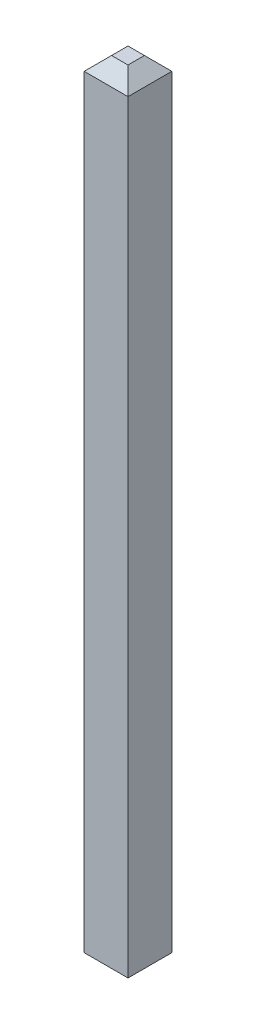
ISO-10303-21;
HEADER;
FILE_DESCRIPTION(('STEP AP214'),'2;1');
FILE_NAME('part.step','',(''),(''),'','','');
FILE_SCHEMA(('AUTOMOTIVE_DESIGN { 1 0 10303 214 1 1 1 1 }'));
ENDSEC;
DATA;
#1=APPLICATION_CONTEXT('core data for automotive mechanical design processes');
#2=APPLICATION_PROTOCOL_DEFINITION('international standard','automotive_design',2000,#1);
#3=PRODUCT_CONTEXT('',#1,'mechanical');
#4=PRODUCT('Part','Part','',(#3));
#5=PRODUCT_RELATED_PRODUCT_CATEGORY('part','',(#4));
#6=PRODUCT_DEFINITION_FORMATION('','',#4);
#7=PRODUCT_DEFINITION_CONTEXT('part definition',#1,'design');
#8=PRODUCT_DEFINITION('design','',#6,#7);
#9=PRODUCT_DEFINITION_SHAPE('','',#8);
#10=(LENGTH_UNIT() NAMED_UNIT(*) SI_UNIT(.MILLI.,.METRE.));
#11=(NAMED_UNIT(*) PLANE_ANGLE_UNIT() SI_UNIT($,.RADIAN.));
#12=(NAMED_UNIT(*) SI_UNIT($,.STERADIAN.) SOLID_ANGLE_UNIT());
#13=UNCERTAINTY_MEASURE_WITH_UNIT(LENGTH_MEASURE(1.E-05),#10,'distance_accuracy_value','');
#14=(GEOMETRIC_REPRESENTATION_CONTEXT(3) GLOBAL_UNCERTAINTY_ASSIGNED_CONTEXT((#13)) GLOBAL_UNIT_ASSIGNED_CONTEXT((#10,
#11,#12)) REPRESENTATION_CONTEXT('',''));
#15=CARTESIAN_POINT('',(0.,0.,0.));
#16=DIRECTION('',(0.,0.,1.));
#17=DIRECTION('',(1.,0.,0.));
#18=AXIS2_PLACEMENT_3D('',#15,#16,#17);
#19=CARTESIAN_POINT('',(-8.57,7.07,-0.32));
#20=DIRECTION('',(-0.707106781186548,-0.707106781186548,0.));
#21=DIRECTION('',(-0.707106781186548,0.707106781186548,0.));
#22=AXIS2_PLACEMENT_3D('',#19,#20,#21);
#23=PLANE('',#22);
#24=DIRECTION('',(0.577350269189626,-0.577350269189626,0.577350269189626));
#25=VECTOR('',#24,1.);
#26=CARTESIAN_POINT('',(-8.783333333333,7.283333333333,0.106666666667));
#27=LINE('',#26,#25);
#28=CARTESIAN_POINT('',(-8.77,7.27,0.12));
#29=VERTEX_POINT('',#28);
#30=CARTESIAN_POINT('',(-8.57,7.07,0.32));
#31=VERTEX_POINT('',#30);
#32=EDGE_CURVE('E68',#29,#31,#27,.T.);
#33=ORIENTED_EDGE('',*,*,#32,.T.);
#34=DIRECTION('',(0.,0.,1.));
#35=VECTOR('',#34,1.);
#36=CARTESIAN_POINT('',(-8.57,7.07,-0.32));
#37=LINE('',#36,#35);
#38=CARTESIAN_POINT('',(-8.57,7.07,-0.32));
#39=VERTEX_POINT('',#38);
#40=EDGE_CURVE('E183',#39,#31,#37,.T.);
#41=ORIENTED_EDGE('',*,*,#40,.F.);
#42=DIRECTION('',(0.577350269189626,-0.577350269189626,-0.577350269189626));
#43=VECTOR('',#42,1.);
#44=CARTESIAN_POINT('',(-8.57,7.07,-0.32));
#45=LINE('',#44,#43);
#46=CARTESIAN_POINT('',(-8.77,7.27,-0.12));
#47=VERTEX_POINT('',#46);
#48=EDGE_CURVE('E11',#47,#39,#45,.T.);
#49=ORIENTED_EDGE('',*,*,#48,.F.);
#50=DIRECTION('',(0.,0.,-1.));
#51=VECTOR('',#50,1.);
#52=CARTESIAN_POINT('',(-8.77,7.27,-0.32));
#53=LINE('',#52,#51);
#54=EDGE_CURVE('E186',#29,#47,#53,.T.);
#55=ORIENTED_EDGE('',*,*,#54,.F.);
#56=EDGE_LOOP('',(#33,#41,#49,#55));
#57=FACE_BOUND('',#56,.T.);
#58=ADVANCED_FACE('F17',(#57),#23,.F.);
#59=CARTESIAN_POINT('',(-8.89,7.07,-0.32));
#60=DIRECTION('',(0.,0.707106781186548,-0.707106781186548));
#61=DIRECTION('',(-1.,0.,0.));
#62=AXIS2_PLACEMENT_3D('',#59,#60,#61);
#63=PLANE('',#62);
#64=DIRECTION('',(0.577350269189626,0.577350269189626,0.577350269189626));
#65=VECTOR('',#64,1.);
#66=CARTESIAN_POINT('',(-9.076666666667,7.203333333333,-0.186666666667));
#67=LINE('',#66,#65);
#68=CARTESIAN_POINT('',(-9.21,7.07,-0.32));
#69=VERTEX_POINT('',#68);
#70=CARTESIAN_POINT('',(-9.01,7.27,-0.12));
#71=VERTEX_POINT('',#70);
#72=EDGE_CURVE('E20',#69,#71,#67,.T.);
#73=ORIENTED_EDGE('',*,*,#72,.T.);
#74=DIRECTION('',(-1.,0.,0.));
#75=VECTOR('',#74,1.);
#76=CARTESIAN_POINT('',(-9.21,7.27,-0.12));
#77=LINE('',#76,#75);
#78=EDGE_CURVE('E190',#47,#71,#77,.T.);
#79=ORIENTED_EDGE('',*,*,#78,.F.);
#80=ORIENTED_EDGE('',*,*,#48,.T.);
#81=DIRECTION('',(1.,0.,0.));
#82=VECTOR('',#81,1.);
#83=CARTESIAN_POINT('',(-8.57,7.07,-0.32));
#84=LINE('',#83,#82);
#85=EDGE_CURVE('E130',#69,#39,#84,.T.);
#86=ORIENTED_EDGE('',*,*,#85,.F.);
#87=EDGE_LOOP('',(#73,#79,#80,#86));
#88=FACE_BOUND('',#87,.T.);
#89=ADVANCED_FACE('F210',(#88),#63,.T.);
#90=CARTESIAN_POINT('',(-9.01,7.27,-0.32));
#91=DIRECTION('',(0.707106781186548,-0.707106781186548,0.));
#92=DIRECTION('',(0.,0.,-1.));
#93=AXIS2_PLACEMENT_3D('',#90,#91,#92);
#94=PLANE('',#93);
#95=DIRECTION('',(-0.577350269189626,-0.577350269189626,0.577350269189626));
#96=VECTOR('',#95,1.);
#97=CARTESIAN_POINT('',(-9.076666666667,7.203333333333,0.186666666667));
#98=LINE('',#97,#96);
#99=CARTESIAN_POINT('',(-9.01,7.27,0.12));
#100=VERTEX_POINT('',#99);
#101=CARTESIAN_POINT('',(-9.21,7.07,0.32));
#102=VERTEX_POINT('',#101);
#103=EDGE_CURVE('E40',#100,#102,#98,.T.);
#104=ORIENTED_EDGE('',*,*,#103,.F.);
#105=DIRECTION('',(0.,0.,1.));
#106=VECTOR('',#105,1.);
#107=CARTESIAN_POINT('',(-9.01,7.27,-0.32));
#108=LINE('',#107,#106);
#109=EDGE_CURVE('E194',#71,#100,#108,.T.);
#110=ORIENTED_EDGE('',*,*,#109,.F.);
#111=ORIENTED_EDGE('',*,*,#72,.F.);
#112=DIRECTION('',(0.,0.,-1.));
#113=VECTOR('',#112,1.);
#114=CARTESIAN_POINT('',(-9.21,7.07,-0.32));
#115=LINE('',#114,#113);
#116=EDGE_CURVE('E119',#102,#69,#115,.T.);
#117=ORIENTED_EDGE('',*,*,#116,.F.);
#118=EDGE_LOOP('',(#104,#110,#111,#117));
#119=FACE_BOUND('',#118,.T.);
#120=ADVANCED_FACE('F211',(#119),#94,.F.);
#121=CARTESIAN_POINT('',(-9.21,7.27,0.12));
#122=DIRECTION('',(0.,-0.707106781186548,-0.707106781186548));
#123=DIRECTION('',(0.,-0.707106781186548,0.707106781186548));
#124=AXIS2_PLACEMENT_3D('',#121,#122,#123);
#125=PLANE('',#124);
#126=ORIENTED_EDGE('',*,*,#32,.F.);
#127=DIRECTION('',(1.,0.,0.));
#128=VECTOR('',#127,1.);
#129=CARTESIAN_POINT('',(-9.21,7.27,0.12));
#130=LINE('',#129,#128);
#131=EDGE_CURVE('E198',#100,#29,#130,.T.);
#132=ORIENTED_EDGE('',*,*,#131,.F.);
#133=ORIENTED_EDGE('',*,*,#103,.T.);
#134=DIRECTION('',(-1.,0.,0.));
#135=VECTOR('',#134,1.);
#136=CARTESIAN_POINT('',(-8.89,7.07,0.32));
#137=LINE('',#136,#135);
#138=EDGE_CURVE('E179',#31,#102,#137,.T.);
#139=ORIENTED_EDGE('',*,*,#138,.F.);
#140=EDGE_LOOP('',(#126,#132,#133,#139));
#141=FACE_BOUND('',#140,.T.);
#142=ADVANCED_FACE('F263',(#141),#125,.F.);
#143=CARTESIAN_POINT('',(-9.21,7.27,-0.32));
#144=DIRECTION('',(0.,-1.,0.));
#145=DIRECTION('',(0.,0.,-1.));
#146=AXIS2_PLACEMENT_3D('',#143,#144,#145);
#147=PLANE('',#146);
#148=ORIENTED_EDGE('',*,*,#54,.T.);
#149=ORIENTED_EDGE('',*,*,#78,.T.);
#150=ORIENTED_EDGE('',*,*,#109,.T.);
#151=ORIENTED_EDGE('',*,*,#131,.T.);
#152=EDGE_LOOP('',(#148,#149,#150,#151));
#153=FACE_BOUND('',#152,.T.);
#154=ADVANCED_FACE('F213',(#153),#147,.F.);
#155=CARTESIAN_POINT('',(-8.57,7.27,-0.32));
#156=DIRECTION('',(-1.,0.,0.));
#157=DIRECTION('',(0.,1.,0.));
#158=AXIS2_PLACEMENT_3D('',#155,#156,#157);
#159=PLANE('',#158);
#160=DIRECTION('',(0.,-1.,0.));
#161=VECTOR('',#160,1.);
#162=CARTESIAN_POINT('',(-8.57,7.27,-0.32));
#163=LINE('',#162,#161);
#164=CARTESIAN_POINT('',(-8.57,-4.07,-0.32));
#165=VERTEX_POINT('',#164);
#166=EDGE_CURVE('E138',#39,#165,#163,.T.);
#167=ORIENTED_EDGE('',*,*,#166,.F.);
#168=ORIENTED_EDGE('',*,*,#40,.T.);
#169=DIRECTION('',(0.,-1.,0.));
#170=VECTOR('',#169,1.);
#171=CARTESIAN_POINT('',(-8.57,7.27,0.32));
#172=LINE('',#171,#170);
#173=CARTESIAN_POINT('',(-8.57,-4.07,0.32));
#174=VERTEX_POINT('',#173);
#175=EDGE_CURVE('E175',#31,#174,#172,.T.);
#176=ORIENTED_EDGE('',*,*,#175,.T.);
#177=DIRECTION('',(0.,0.,-1.));
#178=VECTOR('',#177,1.);
#179=CARTESIAN_POINT('',(-8.57,-4.07,-0.32));
#180=LINE('',#179,#178);
#181=EDGE_CURVE('E165',#174,#165,#180,.T.);
#182=ORIENTED_EDGE('',*,*,#181,.T.);
#183=EDGE_LOOP('',(#167,#168,#176,#182));
#184=FACE_BOUND('',#183,.T.);
#185=ADVANCED_FACE('F218',(#184),#159,.F.);
#186=CARTESIAN_POINT('',(-8.89,1.5,0.32));
#187=DIRECTION('',(0.,0.,-1.));
#188=DIRECTION('',(0.,-1.,0.));
#189=AXIS2_PLACEMENT_3D('',#186,#187,#188);
#190=PLANE('',#189);
#191=ORIENTED_EDGE('',*,*,#175,.F.);
#192=ORIENTED_EDGE('',*,*,#138,.T.);
#193=DIRECTION('',(0.,1.,0.));
#194=VECTOR('',#193,1.);
#195=CARTESIAN_POINT('',(-9.21,-4.27,0.32));
#196=LINE('',#195,#194);
#197=CARTESIAN_POINT('',(-9.21,-4.07,0.32));
#198=VERTEX_POINT('',#197);
#199=EDGE_CURVE('E160',#198,#102,#196,.T.);
#200=ORIENTED_EDGE('',*,*,#199,.F.);
#201=DIRECTION('',(1.,0.,0.));
#202=VECTOR('',#201,1.);
#203=CARTESIAN_POINT('',(-8.89,-4.07,0.32));
#204=LINE('',#203,#202);
#205=EDGE_CURVE('E162',#198,#174,#204,.T.);
#206=ORIENTED_EDGE('',*,*,#205,.T.);
#207=EDGE_LOOP('',(#191,#192,#200,#206));
#208=FACE_BOUND('',#207,.T.);
#209=ADVANCED_FACE('F227',(#208),#190,.F.);
#210=CARTESIAN_POINT('',(-8.77,-4.27,-0.32));
#211=DIRECTION('',(-0.707106781186548,0.707106781186548,0.));
#212=DIRECTION('',(0.,0.,1.));
#213=AXIS2_PLACEMENT_3D('',#210,#211,#212);
#214=PLANE('',#213);
#215=DIRECTION('',(-0.577350269189626,-0.577350269189626,0.577350269189626));
#216=VECTOR('',#215,1.);
#217=CARTESIAN_POINT('',(-8.703333333333,-4.203333333333,-0.186666666667));
#218=LINE('',#217,#216);
#219=CARTESIAN_POINT('',(-8.77,-4.27,-0.12));
#220=VERTEX_POINT('',#219);
#221=EDGE_CURVE('E131',#165,#220,#218,.T.);
#222=ORIENTED_EDGE('',*,*,#221,.F.);
#223=ORIENTED_EDGE('',*,*,#181,.F.);
#224=DIRECTION('',(-0.577350269189626,-0.577350269189626,-0.577350269189626));
#225=VECTOR('',#224,1.);
#226=CARTESIAN_POINT('',(-8.916666666667,-4.416666666667,-0.02666666666667));
#227=LINE('',#226,#225);
#228=CARTESIAN_POINT('',(-8.77,-4.27,0.12));
#229=VERTEX_POINT('',#228);
#230=EDGE_CURVE('E166',#174,#229,#227,.T.);
#231=ORIENTED_EDGE('',*,*,#230,.T.);
#232=DIRECTION('',(0.,0.,1.));
#233=VECTOR('',#232,1.);
#234=CARTESIAN_POINT('',(-8.77,-4.27,-0.32));
#235=LINE('',#234,#233);
#236=EDGE_CURVE('E239',#220,#229,#235,.T.);
#237=ORIENTED_EDGE('',*,*,#236,.F.);
#238=EDGE_LOOP('',(#222,#223,#231,#237));
#239=FACE_BOUND('',#238,.T.);
#240=ADVANCED_FACE('F222',(#239),#214,.F.);
#241=CARTESIAN_POINT('',(-8.57,-4.27,0.12));
#242=DIRECTION('',(0.,0.707106781186548,-0.707106781186548));
#243=DIRECTION('',(-1.,0.,0.));
#244=AXIS2_PLACEMENT_3D('',#241,#242,#243);
#245=PLANE('',#244);
#246=ORIENTED_EDGE('',*,*,#230,.F.);
#247=ORIENTED_EDGE('',*,*,#205,.F.);
#248=DIRECTION('',(-0.577350269189626,0.577350269189626,0.577350269189626));
#249=VECTOR('',#248,1.);
#250=CARTESIAN_POINT('',(-8.996666666667,-4.283333333333,0.106666666667));
#251=LINE('',#250,#249);
#252=CARTESIAN_POINT('',(-9.01,-4.27,0.12));
#253=VERTEX_POINT('',#252);
#254=EDGE_CURVE('E114',#253,#198,#251,.T.);
#255=ORIENTED_EDGE('',*,*,#254,.F.);
#256=DIRECTION('',(-1.,0.,0.));
#257=VECTOR('',#256,1.);
#258=CARTESIAN_POINT('',(-8.57,-4.27,0.12));
#259=LINE('',#258,#257);
#260=EDGE_CURVE('E231',#229,#253,#259,.T.);
#261=ORIENTED_EDGE('',*,*,#260,.F.);
#262=EDGE_LOOP('',(#246,#247,#255,#261));
#263=FACE_BOUND('',#262,.T.);
#264=ADVANCED_FACE('F229',(#263),#245,.F.);
#265=CARTESIAN_POINT('',(-9.21,-4.07,-0.32));
#266=DIRECTION('',(0.707106781186548,0.707106781186548,0.));
#267=DIRECTION('',(0.,0.,-1.));
#268=AXIS2_PLACEMENT_3D('',#265,#266,#267);
#269=PLANE('',#268);
#270=DIRECTION('',(0.577350269189626,-0.577350269189626,0.577350269189626));
#271=VECTOR('',#270,1.);
#272=CARTESIAN_POINT('',(-9.103333333333,-4.176666666667,-0.213333333333));
#273=LINE('',#272,#271);
#274=CARTESIAN_POINT('',(-9.21,-4.07,-0.32));
#275=VERTEX_POINT('',#274);
#276=CARTESIAN_POINT('',(-9.01,-4.27,-0.12));
#277=VERTEX_POINT('',#276);
#278=EDGE_CURVE('E112',#275,#277,#273,.T.);
#279=ORIENTED_EDGE('',*,*,#278,.T.);
#280=DIRECTION('',(0.,0.,-1.));
#281=VECTOR('',#280,1.);
#282=CARTESIAN_POINT('',(-9.01,-4.27,-0.32));
#283=LINE('',#282,#281);
#284=EDGE_CURVE('E154',#253,#277,#283,.T.);
#285=ORIENTED_EDGE('',*,*,#284,.F.);
#286=ORIENTED_EDGE('',*,*,#254,.T.);
#287=DIRECTION('',(0.,0.,1.));
#288=VECTOR('',#287,1.);
#289=CARTESIAN_POINT('',(-9.21,-4.07,-0.32));
#290=LINE('',#289,#288);
#291=EDGE_CURVE('E107',#275,#198,#290,.T.);
#292=ORIENTED_EDGE('',*,*,#291,.F.);
#293=EDGE_LOOP('',(#279,#285,#286,#292));
#294=FACE_BOUND('',#293,.T.);
#295=ADVANCED_FACE('F109',(#294),#269,.F.);
#296=CARTESIAN_POINT('',(-9.21,-4.27,-0.32));
#297=DIRECTION('',(1.,0.,0.));
#298=DIRECTION('',(0.,0.,1.));
#299=AXIS2_PLACEMENT_3D('',#296,#297,#298);
#300=PLANE('',#299);
#301=ORIENTED_EDGE('',*,*,#199,.T.);
#302=ORIENTED_EDGE('',*,*,#116,.T.);
#303=DIRECTION('',(0.,1.,0.));
#304=VECTOR('',#303,1.);
#305=CARTESIAN_POINT('',(-9.21,-4.27,-0.32));
#306=LINE('',#305,#304);
#307=EDGE_CURVE('E123',#275,#69,#306,.T.);
#308=ORIENTED_EDGE('',*,*,#307,.F.);
#309=ORIENTED_EDGE('',*,*,#291,.T.);
#310=EDGE_LOOP('',(#301,#302,#308,#309));
#311=FACE_BOUND('',#310,.T.);
#312=ADVANCED_FACE('F125',(#311),#300,.F.);
#313=CARTESIAN_POINT('',(-8.89,1.5,-0.32));
#314=DIRECTION('',(0.,0.,-1.));
#315=DIRECTION('',(0.,-1.,0.));
#316=AXIS2_PLACEMENT_3D('',#313,#314,#315);
#317=PLANE('',#316);
#318=ORIENTED_EDGE('',*,*,#307,.T.);
#319=ORIENTED_EDGE('',*,*,#85,.T.);
#320=ORIENTED_EDGE('',*,*,#166,.T.);
#321=DIRECTION('',(-1.,0.,0.));
#322=VECTOR('',#321,1.);
#323=CARTESIAN_POINT('',(-9.21,-4.07,-0.32));
#324=LINE('',#323,#322);
#325=EDGE_CURVE('E135',#165,#275,#324,.T.);
#326=ORIENTED_EDGE('',*,*,#325,.T.);
#327=EDGE_LOOP('',(#318,#319,#320,#326));
#328=FACE_BOUND('',#327,.T.);
#329=ADVANCED_FACE('F136',(#328),#317,.T.);
#330=CARTESIAN_POINT('',(-8.89,-4.07,-0.32));
#331=DIRECTION('',(0.,-0.707106781186548,-0.707106781186548));
#332=DIRECTION('',(0.,-0.707106781186548,0.707106781186548));
#333=AXIS2_PLACEMENT_3D('',#330,#331,#332);
#334=PLANE('',#333);
#335=ORIENTED_EDGE('',*,*,#278,.F.);
#336=ORIENTED_EDGE('',*,*,#325,.F.);
#337=ORIENTED_EDGE('',*,*,#221,.T.);
#338=DIRECTION('',(1.,0.,0.));
#339=VECTOR('',#338,1.);
#340=CARTESIAN_POINT('',(-8.57,-4.27,-0.12));
#341=LINE('',#340,#339);
#342=EDGE_CURVE('E146',#277,#220,#341,.T.);
#343=ORIENTED_EDGE('',*,*,#342,.F.);
#344=EDGE_LOOP('',(#335,#336,#337,#343));
#345=FACE_BOUND('',#344,.T.);
#346=ADVANCED_FACE('F144',(#345),#334,.T.);
#347=CARTESIAN_POINT('',(-8.57,-4.27,-0.32));
#348=DIRECTION('',(0.,1.,0.));
#349=DIRECTION('',(0.,0.,-1.));
#350=AXIS2_PLACEMENT_3D('',#347,#348,#349);
#351=PLANE('',#350);
#352=ORIENTED_EDGE('',*,*,#236,.T.);
#353=ORIENTED_EDGE('',*,*,#260,.T.);
#354=ORIENTED_EDGE('',*,*,#284,.T.);
#355=ORIENTED_EDGE('',*,*,#342,.T.);
#356=EDGE_LOOP('',(#352,#353,#354,#355));
#357=FACE_BOUND('',#356,.T.);
#358=ADVANCED_FACE('F251',(#357),#351,.F.);
#359=CLOSED_SHELL('',(#58,#89,#120,#142,#154,#185,#209,#240,#264,#295,#312,#329,#346,#358));
#360=MANIFOLD_SOLID_BREP('B1',#359);
#361=ADVANCED_BREP_SHAPE_REPRESENTATION('',(#18,#360),#14);
#362=SHAPE_DEFINITION_REPRESENTATION(#9,#361);
ENDSEC;
END-ISO-10303-21;
